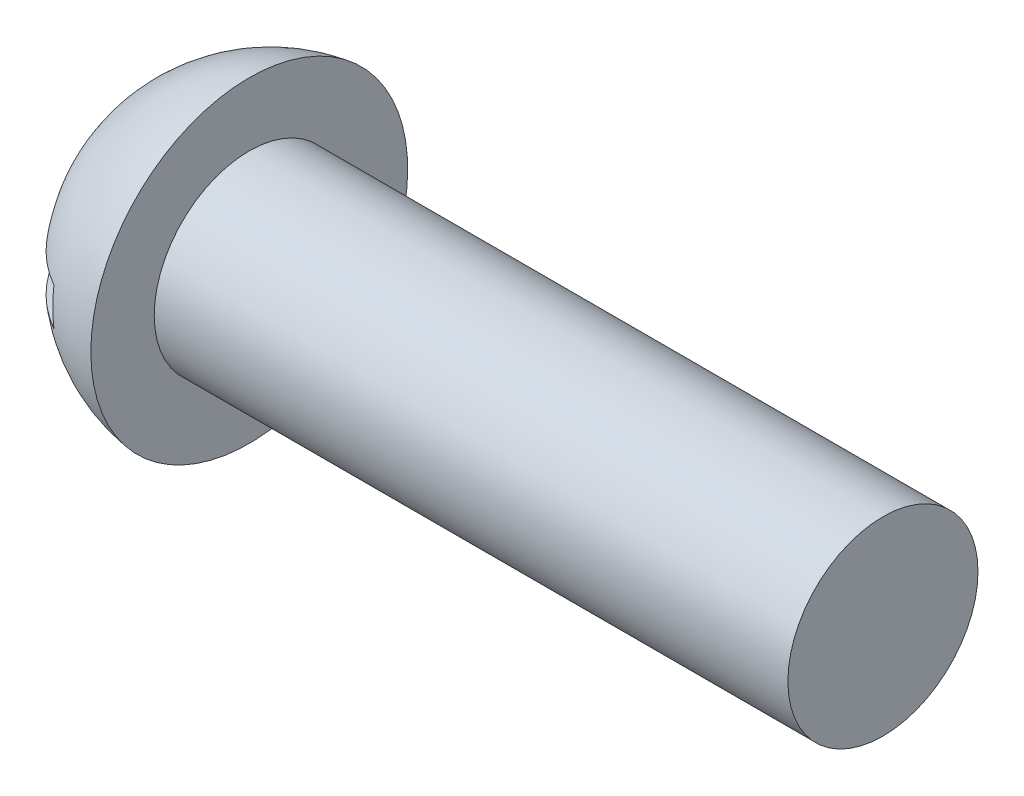
ISO-10303-21;
HEADER;
FILE_DESCRIPTION(('STEP AP214'),'2;1');
FILE_NAME('part.step','',(''),(''),'','','');
FILE_SCHEMA(('AUTOMOTIVE_DESIGN { 1 0 10303 214 1 1 1 1 }'));
ENDSEC;
DATA;
#1=APPLICATION_CONTEXT('core data for automotive mechanical design processes');
#2=APPLICATION_PROTOCOL_DEFINITION('international standard','automotive_design',2000,#1);
#3=PRODUCT_CONTEXT('',#1,'mechanical');
#4=PRODUCT('Part','Part','',(#3));
#5=PRODUCT_RELATED_PRODUCT_CATEGORY('part','',(#4));
#6=PRODUCT_DEFINITION_FORMATION('','',#4);
#7=PRODUCT_DEFINITION_CONTEXT('part definition',#1,'design');
#8=PRODUCT_DEFINITION('design','',#6,#7);
#9=PRODUCT_DEFINITION_SHAPE('','',#8);
#10=(LENGTH_UNIT() NAMED_UNIT(*) SI_UNIT(.MILLI.,.METRE.));
#11=(NAMED_UNIT(*) PLANE_ANGLE_UNIT() SI_UNIT($,.RADIAN.));
#12=(NAMED_UNIT(*) SI_UNIT($,.STERADIAN.) SOLID_ANGLE_UNIT());
#13=UNCERTAINTY_MEASURE_WITH_UNIT(LENGTH_MEASURE(1.E-05),#10,'distance_accuracy_value','');
#14=(GEOMETRIC_REPRESENTATION_CONTEXT(3) GLOBAL_UNCERTAINTY_ASSIGNED_CONTEXT((#13)) GLOBAL_UNIT_ASSIGNED_CONTEXT((#10,
#11,#12)) REPRESENTATION_CONTEXT('',''));
#15=CARTESIAN_POINT('',(0.,0.,0.));
#16=DIRECTION('',(0.,0.,1.));
#17=DIRECTION('',(1.,0.,0.));
#18=AXIS2_PLACEMENT_3D('',#15,#16,#17);
#19=CARTESIAN_POINT('',(8.128,-1.8923,-15.875));
#20=DIRECTION('',(1.,0.,0.));
#21=DIRECTION('',(0.,0.,-1.));
#22=AXIS2_PLACEMENT_3D('',#19,#20,#21);
#23=PLANE('',#22);
#24=DIRECTION('',(0.,0.,-1.));
#25=VECTOR('',#24,1.);
#26=CARTESIAN_POINT('',(8.128,0.780906045340105,-15.875));
#27=LINE('',#26,#25);
#28=CARTESIAN_POINT('',(8.128,0.780906045340053,-0.780906045340051));
#29=VERTEX_POINT('',#28);
#30=CARTESIAN_POINT('',(8.128,0.780906045340057,-2.12828967254408));
#31=VERTEX_POINT('',#30);
#32=EDGE_CURVE('E180',#29,#31,#27,.T.);
#33=ORIENTED_EDGE('',*,*,#32,.F.);
#34=DIRECTION('',(0.,-1.,0.));
#35=VECTOR('',#34,1.);
#36=CARTESIAN_POINT('',(8.128,-1.8923,-0.780906045340051));
#37=LINE('',#36,#35);
#38=CARTESIAN_POINT('',(8.128,1.8923,-0.780906045340051));
#39=VERTEX_POINT('',#38);
#40=EDGE_CURVE('E230',#39,#29,#37,.T.);
#41=ORIENTED_EDGE('',*,*,#40,.F.);
#42=DIRECTION('',(0.,0.,1.));
#43=VECTOR('',#42,1.);
#44=CARTESIAN_POINT('',(8.128,1.8923,-15.875));
#45=LINE('',#44,#43);
#46=CARTESIAN_POINT('',(8.128,1.8923,-13.8099626122346));
#47=VERTEX_POINT('',#46);
#48=EDGE_CURVE('E55',#47,#39,#45,.T.);
#49=ORIENTED_EDGE('',*,*,#48,.F.);
#50=CARTESIAN_POINT('',(8.128,0.,0.));
#51=DIRECTION('',(1.,0.,0.));
#52=DIRECTION('',(0.,0.,-1.));
#53=AXIS2_PLACEMENT_3D('',#50,#51,#52);
#54=CIRCLE('',#53,13.9390052242374);
#55=CARTESIAN_POINT('',(8.128,-1.8923,-13.8099626122346));
#56=VERTEX_POINT('',#55);
#57=EDGE_CURVE('E215',#47,#56,#54,.F.);
#58=ORIENTED_EDGE('',*,*,#57,.T.);
#59=DIRECTION('',(0.,0.,-1.));
#60=VECTOR('',#59,1.);
#61=CARTESIAN_POINT('',(8.128,-1.8923,15.875));
#62=LINE('',#61,#60);
#63=CARTESIAN_POINT('',(8.128,-1.8923,-0.780906045340051));
#64=VERTEX_POINT('',#63);
#65=EDGE_CURVE('E204',#64,#56,#62,.T.);
#66=ORIENTED_EDGE('',*,*,#65,.F.);
#67=CARTESIAN_POINT('',(8.128,-0.780906045340048,-0.780906045340051));
#68=VERTEX_POINT('',#67);
#69=EDGE_CURVE('E228',#68,#64,#37,.T.);
#70=ORIENTED_EDGE('',*,*,#69,.F.);
#71=DIRECTION('',(0.,0.,1.));
#72=VECTOR('',#71,1.);
#73=CARTESIAN_POINT('',(8.128,-0.780906045339993,-15.875));
#74=LINE('',#73,#72);
#75=CARTESIAN_POINT('',(8.128,-0.780906045340043,-2.12828967254408));
#76=VERTEX_POINT('',#75);
#77=EDGE_CURVE('E280',#76,#68,#74,.T.);
#78=ORIENTED_EDGE('',*,*,#77,.F.);
#79=DIRECTION('',(0.,1.,0.));
#80=VECTOR('',#79,1.);
#81=CARTESIAN_POINT('',(8.128,-1.89230000000006,-2.12828967254409));
#82=LINE('',#81,#80);
#83=EDGE_CURVE('E151',#76,#31,#82,.T.);
#84=ORIENTED_EDGE('',*,*,#83,.T.);
#85=EDGE_LOOP('',(#33,#41,#49,#58,#66,#70,#78,#84));
#86=FACE_BOUND('',#85,.T.);
#87=ADVANCED_FACE('F32',(#86),#23,.F.);
#88=DIRECTION('',(0.,0.,-1.));
#89=VECTOR('',#88,1.);
#90=CARTESIAN_POINT('',(8.128,0.780906045340105,-15.875));
#91=LINE('',#90,#89);
#92=CARTESIAN_POINT('',(8.128,0.780906045340043,2.12828967254408));
#93=VERTEX_POINT('',#92);
#94=CARTESIAN_POINT('',(8.128,0.780906045340048,0.780906045340048));
#95=VERTEX_POINT('',#94);
#96=EDGE_CURVE('E139',#93,#95,#91,.T.);
#97=ORIENTED_EDGE('',*,*,#96,.F.);
#98=DIRECTION('',(0.,-1.,0.));
#99=VECTOR('',#98,1.);
#100=CARTESIAN_POINT('',(8.128,-1.89230000000006,2.12828967254407));
#101=LINE('',#100,#99);
#102=CARTESIAN_POINT('',(8.128,-0.780906045340058,2.12828967254408));
#103=VERTEX_POINT('',#102);
#104=EDGE_CURVE('E150',#93,#103,#101,.T.);
#105=ORIENTED_EDGE('',*,*,#104,.T.);
#106=DIRECTION('',(0.,0.,1.));
#107=VECTOR('',#106,1.);
#108=CARTESIAN_POINT('',(8.128,-0.780906045339993,-15.875));
#109=LINE('',#108,#107);
#110=CARTESIAN_POINT('',(8.128,-0.780906045340053,0.780906045340048));
#111=VERTEX_POINT('',#110);
#112=EDGE_CURVE('E275',#111,#103,#109,.T.);
#113=ORIENTED_EDGE('',*,*,#112,.F.);
#114=DIRECTION('',(0.,1.,0.));
#115=VECTOR('',#114,1.);
#116=CARTESIAN_POINT('',(8.128,-1.8923,0.780906045340046));
#117=LINE('',#116,#115);
#118=CARTESIAN_POINT('',(8.128,-1.8923,0.780906045340046));
#119=VERTEX_POINT('',#118);
#120=EDGE_CURVE('E226',#119,#111,#117,.T.);
#121=ORIENTED_EDGE('',*,*,#120,.F.);
#122=CARTESIAN_POINT('',(8.128,-1.8923,13.8099626122346));
#123=VERTEX_POINT('',#122);
#124=EDGE_CURVE('E200',#123,#119,#62,.T.);
#125=ORIENTED_EDGE('',*,*,#124,.F.);
#126=CARTESIAN_POINT('',(8.128,1.8923,13.8099626122346));
#127=VERTEX_POINT('',#126);
#128=EDGE_CURVE('E218',#123,#127,#54,.F.);
#129=ORIENTED_EDGE('',*,*,#128,.T.);
#130=CARTESIAN_POINT('',(8.128,1.8923,0.780906045340046));
#131=VERTEX_POINT('',#130);
#132=EDGE_CURVE('E203',#131,#127,#45,.T.);
#133=ORIENTED_EDGE('',*,*,#132,.F.);
#134=EDGE_CURVE('E229',#95,#131,#117,.T.);
#135=ORIENTED_EDGE('',*,*,#134,.F.);
#136=EDGE_LOOP('',(#97,#105,#113,#121,#125,#129,#133,#135));
#137=FACE_BOUND('',#136,.T.);
#138=ADVANCED_FACE('F272',(#137),#23,.F.);
#139=CARTESIAN_POINT('',(10.9514954051796,0.,-0.597770008354219));
#140=DIRECTION('',(-0.0647254535664844,0.,0.997903109355118));
#141=DIRECTION('',(0.997903109355118,0.,0.0647254535664844));
#142=AXIS2_PLACEMENT_3D('',#139,#140,#141);
#143=PLANE('',#142);
#144=ORIENTED_EDGE('',*,*,#40,.T.);
#145=DIRECTION('',(0.995819354482396,-0.0645902981811632,0.064590298181163));
#146=VECTOR('',#145,1.);
#147=CARTESIAN_POINT('',(10.9899441329414,0.59527616769965,-0.595276167699648));
#148=LINE('',#147,#146);
#149=CARTESIAN_POINT('',(10.0838,0.654050000000002,-0.654049999999997));
#150=VERTEX_POINT('',#149);
#151=EDGE_CURVE('E238',#29,#150,#148,.T.);
#152=ORIENTED_EDGE('',*,*,#151,.T.);
#153=DIRECTION('',(0.797480422628462,-0.601123467182789,0.0517257452964305));
#154=VECTOR('',#153,1.);
#155=CARTESIAN_POINT('',(0.,8.255,-1.3081));
#156=LINE('',#155,#154);
#157=CARTESIAN_POINT('',(1.6618990815732,7.00229647314665,-1.20030679760577));
#158=VERTEX_POINT('',#157);
#159=EDGE_CURVE('E162',#158,#150,#156,.T.);
#160=ORIENTED_EDGE('',*,*,#159,.F.);
#161=CARTESIAN_POINT('',(16.0336471531862,0.,-0.268134221172429));
#162=DIRECTION('',(-0.0647254535664844,0.,0.997903109355118));
#163=DIRECTION('',(0.997903109355118,0.,0.0647254535664844));
#164=AXIS2_PLACEMENT_3D('',#161,#162,#163);
#165=CIRCLE('',#164,16.0140015063072);
#166=CARTESIAN_POINT('',(0.165185159653955,1.8923,-1.2973858492164));
#167=VERTEX_POINT('',#166);
#168=EDGE_CURVE('E196',#167,#158,#165,.F.);
#169=ORIENTED_EDGE('',*,*,#168,.F.);
#170=DIRECTION('',(-0.997903109355118,0.,-0.0647254535664844));
#171=VECTOR('',#170,1.);
#172=CARTESIAN_POINT('',(7.1530765262189,1.8923,-0.84414100617094));
#173=LINE('',#172,#171);
#174=EDGE_CURVE('E193',#39,#167,#173,.T.);
#175=ORIENTED_EDGE('',*,*,#174,.F.);
#176=EDGE_LOOP('',(#144,#152,#160,#169,#175));
#177=FACE_BOUND('',#176,.T.);
#178=ADVANCED_FACE('F237',(#177),#143,.T.);
#179=DIRECTION('',(0.797480422628462,0.601123467182789,0.0517257452964305));
#180=VECTOR('',#179,1.);
#181=CARTESIAN_POINT('',(0.,-8.255,-1.3081));
#182=LINE('',#181,#180);
#183=CARTESIAN_POINT('',(1.66189908157319,-7.00229647314666,-1.20030679760577));
#184=VERTEX_POINT('',#183);
#185=CARTESIAN_POINT('',(10.0838,-0.65405,-0.65405));
#186=VERTEX_POINT('',#185);
#187=EDGE_CURVE('E163',#184,#186,#182,.T.);
#188=ORIENTED_EDGE('',*,*,#187,.T.);
#189=DIRECTION('',(-0.995819354482397,-0.0645902981811627,-0.064590298181163));
#190=VECTOR('',#189,1.);
#191=CARTESIAN_POINT('',(10.9899441329414,-0.595276167699646,-0.595276167699648));
#192=LINE('',#191,#190);
#193=EDGE_CURVE('E277',#186,#68,#192,.T.);
#194=ORIENTED_EDGE('',*,*,#193,.T.);
#195=ORIENTED_EDGE('',*,*,#69,.T.);
#196=DIRECTION('',(0.997903109355118,0.,0.0647254535664844));
#197=VECTOR('',#196,1.);
#198=CARTESIAN_POINT('',(9.20380049716607,-1.8923,-0.711128053395398));
#199=LINE('',#198,#197);
#200=CARTESIAN_POINT('',(0.165185159653955,-1.8923,-1.2973858492164));
#201=VERTEX_POINT('',#200);
#202=EDGE_CURVE('E190',#201,#64,#199,.T.);
#203=ORIENTED_EDGE('',*,*,#202,.F.);
#204=EDGE_CURVE('E199',#184,#201,#165,.F.);
#205=ORIENTED_EDGE('',*,*,#204,.F.);
#206=EDGE_LOOP('',(#188,#194,#195,#203,#205));
#207=FACE_BOUND('',#206,.T.);
#208=ADVANCED_FACE('F293',(#207),#143,.T.);
#209=CARTESIAN_POINT('',(10.9514954051796,0.,0.597770008354219));
#210=DIRECTION('',(-0.0647254535664843,0.,-0.997903109355118));
#211=DIRECTION('',(-0.997903109355118,0.,0.0647254535664843));
#212=AXIS2_PLACEMENT_3D('',#209,#210,#211);
#213=PLANE('',#212);
#214=DIRECTION('',(0.797480422628462,-0.601123467182789,-0.0517257452964305));
#215=VECTOR('',#214,1.);
#216=CARTESIAN_POINT('',(0.,8.255,1.3081));
#217=LINE('',#216,#215);
#218=CARTESIAN_POINT('',(1.6618990815732,7.00229647314665,1.20030679760577));
#219=VERTEX_POINT('',#218);
#220=CARTESIAN_POINT('',(10.0838,0.654049999999998,0.654050000000002));
#221=VERTEX_POINT('',#220);
#222=EDGE_CURVE('E155',#219,#221,#217,.T.);
#223=ORIENTED_EDGE('',*,*,#222,.T.);
#224=DIRECTION('',(-0.995819354482397,0.0645902981811628,0.0645902981811629));
#225=VECTOR('',#224,1.);
#226=CARTESIAN_POINT('',(10.9899441329414,0.595276167699645,0.595276167699648));
#227=LINE('',#226,#225);
#228=EDGE_CURVE('E11',#221,#95,#227,.T.);
#229=ORIENTED_EDGE('',*,*,#228,.T.);
#230=ORIENTED_EDGE('',*,*,#134,.T.);
#231=DIRECTION('',(0.997903109355118,0.,-0.0647254535664843));
#232=VECTOR('',#231,1.);
#233=CARTESIAN_POINT('',(9.20380049716607,1.8923,0.711128053395398));
#234=LINE('',#233,#232);
#235=CARTESIAN_POINT('',(0.165185159653958,1.8923,1.2973858492164));
#236=VERTEX_POINT('',#235);
#237=EDGE_CURVE('E185',#236,#131,#234,.T.);
#238=ORIENTED_EDGE('',*,*,#237,.F.);
#239=CARTESIAN_POINT('',(16.0336471531862,0.,0.26813422117243));
#240=DIRECTION('',(-0.0647254535664843,0.,-0.997903109355118));
#241=DIRECTION('',(-0.997903109355118,0.,0.0647254535664843));
#242=AXIS2_PLACEMENT_3D('',#239,#240,#241);
#243=CIRCLE('',#242,16.0140015063072);
#244=EDGE_CURVE('E158',#219,#236,#243,.F.);
#245=ORIENTED_EDGE('',*,*,#244,.F.);
#246=EDGE_LOOP('',(#223,#229,#230,#238,#245));
#247=FACE_BOUND('',#246,.T.);
#248=ADVANCED_FACE('F156',(#247),#213,.T.);
#249=ORIENTED_EDGE('',*,*,#120,.T.);
#250=DIRECTION('',(0.995819354482396,0.0645902981811631,-0.0645902981811629));
#251=VECTOR('',#250,1.);
#252=CARTESIAN_POINT('',(10.9899441329414,-0.59527616769965,0.595276167699648));
#253=LINE('',#252,#251);
#254=CARTESIAN_POINT('',(10.0838,-0.65405,0.65405));
#255=VERTEX_POINT('',#254);
#256=EDGE_CURVE('E264',#111,#255,#253,.T.);
#257=ORIENTED_EDGE('',*,*,#256,.T.);
#258=DIRECTION('',(0.797480422628462,0.601123467182789,-0.0517257452964303));
#259=VECTOR('',#258,1.);
#260=CARTESIAN_POINT('',(0.,-8.255,1.3081));
#261=LINE('',#260,#259);
#262=CARTESIAN_POINT('',(1.6618990815732,-7.00229647314666,1.20030679760577));
#263=VERTEX_POINT('',#262);
#264=EDGE_CURVE('E254',#263,#255,#261,.T.);
#265=ORIENTED_EDGE('',*,*,#264,.F.);
#266=CARTESIAN_POINT('',(0.165185159653958,-1.8923,1.2973858492164));
#267=VERTEX_POINT('',#266);
#268=EDGE_CURVE('E189',#267,#263,#243,.F.);
#269=ORIENTED_EDGE('',*,*,#268,.F.);
#270=DIRECTION('',(-0.997903109355118,0.,0.0647254535664843));
#271=VECTOR('',#270,1.);
#272=CARTESIAN_POINT('',(7.1530765262189,-1.8923,0.844141006170938));
#273=LINE('',#272,#271);
#274=EDGE_CURVE('E47',#119,#267,#273,.T.);
#275=ORIENTED_EDGE('',*,*,#274,.F.);
#276=EDGE_LOOP('',(#249,#257,#265,#269,#275));
#277=FACE_BOUND('',#276,.T.);
#278=ADVANCED_FACE('F263',(#277),#213,.T.);
#279=CARTESIAN_POINT('',(16.0162555758684,0.,0.));
#280=DIRECTION('',(-1.,0.,0.));
#281=DIRECTION('',(0.,1.,0.));
#282=AXIS2_PLACEMENT_3D('',#279,#280,#281);
#283=SPHERICAL_SURFACE('',#282,16.0162555758684);
#284=CARTESIAN_POINT('',(13.8938,0.,0.));
#285=DIRECTION('',(-1.,0.,0.));
#286=DIRECTION('',(0.,0.,1.));
#287=AXIS2_PLACEMENT_3D('',#284,#285,#286);
#288=CIRCLE('',#287,15.875);
#289=CARTESIAN_POINT('',(13.8938,0.,15.875));
#290=VERTEX_POINT('',#289);
#291=EDGE_CURVE('E212',#290,#290,#288,.T.);
#292=ORIENTED_EDGE('',*,*,#291,.T.);
#293=EDGE_LOOP('',(#292));
#294=FACE_BOUND('',#293,.T.);
#295=CARTESIAN_POINT('',(16.0162555758684,1.8923,0.));
#296=DIRECTION('',(0.,-1.,0.));
#297=DIRECTION('',(0.,0.,-1.));
#298=AXIS2_PLACEMENT_3D('',#295,#296,#297);
#299=CIRCLE('',#298,15.9040763133712);
#300=EDGE_CURVE('E223',#47,#167,#299,.F.);
#301=ORIENTED_EDGE('',*,*,#300,.T.);
#302=ORIENTED_EDGE('',*,*,#168,.T.);
#303=CARTESIAN_POINT('',(14.181197617256,-2.43447956414071,0.));
#304=DIRECTION('',(0.601929253251909,0.798549418683402,0.));
#305=DIRECTION('',(-0.798549418683402,0.601929253251909,0.));
#306=AXIS2_PLACEMENT_3D('',#303,#304,#305);
#307=CIRCLE('',#306,15.7234320112325);
#308=EDGE_CURVE('E40',#219,#158,#307,.F.);
#309=ORIENTED_EDGE('',*,*,#308,.F.);
#310=ORIENTED_EDGE('',*,*,#244,.T.);
#311=EDGE_CURVE('E222',#236,#127,#299,.F.);
#312=ORIENTED_EDGE('',*,*,#311,.T.);
#313=ORIENTED_EDGE('',*,*,#128,.F.);
#314=CARTESIAN_POINT('',(16.0162555758684,-1.8923,0.));
#315=DIRECTION('',(0.,1.,0.));
#316=DIRECTION('',(0.,0.,1.));
#317=AXIS2_PLACEMENT_3D('',#314,#315,#316);
#318=CIRCLE('',#317,15.9040763133712);
#319=EDGE_CURVE('E219',#123,#267,#318,.F.);
#320=ORIENTED_EDGE('',*,*,#319,.T.);
#321=ORIENTED_EDGE('',*,*,#268,.T.);
#322=CARTESIAN_POINT('',(14.181197617256,2.43447956414071,0.));
#323=DIRECTION('',(0.601929253251909,-0.798549418683402,0.));
#324=DIRECTION('',(0.798549418683402,0.601929253251909,0.));
#325=AXIS2_PLACEMENT_3D('',#322,#323,#324);
#326=CIRCLE('',#325,15.7234320112325);
#327=EDGE_CURVE('E233',#184,#263,#326,.F.);
#328=ORIENTED_EDGE('',*,*,#327,.F.);
#329=ORIENTED_EDGE('',*,*,#204,.T.);
#330=EDGE_CURVE('E217',#201,#56,#318,.F.);
#331=ORIENTED_EDGE('',*,*,#330,.T.);
#332=ORIENTED_EDGE('',*,*,#57,.F.);
#333=EDGE_LOOP('',(#301,#302,#309,#310,#312,#313,#320,#321,#328,#329,#331,#332));
#334=FACE_BOUND('',#333,.T.);
#335=ADVANCED_FACE('F34',(#294,#334),#283,.T.);
#336=CARTESIAN_POINT('',(8.128,1.8923,-15.875));
#337=DIRECTION('',(0.,-1.,0.));
#338=DIRECTION('',(0.,0.,-1.));
#339=AXIS2_PLACEMENT_3D('',#336,#337,#338);
#340=PLANE('',#339);
#341=ORIENTED_EDGE('',*,*,#48,.T.);
#342=ORIENTED_EDGE('',*,*,#174,.T.);
#343=ORIENTED_EDGE('',*,*,#300,.F.);
#344=EDGE_LOOP('',(#341,#342,#343));
#345=FACE_BOUND('',#344,.T.);
#346=ADVANCED_FACE('F242',(#345),#340,.T.);
#347=ORIENTED_EDGE('',*,*,#311,.F.);
#348=ORIENTED_EDGE('',*,*,#237,.T.);
#349=ORIENTED_EDGE('',*,*,#132,.T.);
#350=EDGE_LOOP('',(#347,#348,#349));
#351=FACE_BOUND('',#350,.T.);
#352=ADVANCED_FACE('F300',(#351),#340,.T.);
#353=CARTESIAN_POINT('',(8.128,-1.8923,15.875));
#354=DIRECTION('',(0.,1.,0.));
#355=DIRECTION('',(0.,0.,1.));
#356=AXIS2_PLACEMENT_3D('',#353,#354,#355);
#357=PLANE('',#356);
#358=ORIENTED_EDGE('',*,*,#330,.F.);
#359=ORIENTED_EDGE('',*,*,#202,.T.);
#360=ORIENTED_EDGE('',*,*,#65,.T.);
#361=EDGE_LOOP('',(#358,#359,#360));
#362=FACE_BOUND('',#361,.T.);
#363=ADVANCED_FACE('F298',(#362),#357,.T.);
#364=ORIENTED_EDGE('',*,*,#124,.T.);
#365=ORIENTED_EDGE('',*,*,#274,.T.);
#366=ORIENTED_EDGE('',*,*,#319,.F.);
#367=EDGE_LOOP('',(#364,#365,#366));
#368=FACE_BOUND('',#367,.T.);
#369=ADVANCED_FACE('F270',(#368),#357,.T.);
#370=CARTESIAN_POINT('',(13.8938,9.52499999999998,0.));
#371=DIRECTION('',(-1.,0.,0.));
#372=DIRECTION('',(0.,0.,1.));
#373=AXIS2_PLACEMENT_3D('',#370,#371,#372);
#374=PLANE('',#373);
#375=ORIENTED_EDGE('',*,*,#291,.F.);
#376=EDGE_LOOP('',(#375));
#377=FACE_BOUND('',#376,.T.);
#378=CARTESIAN_POINT('',(13.8938,0.,0.));
#379=DIRECTION('',(-1.,0.,0.));
#380=DIRECTION('',(0.,0.,1.));
#381=AXIS2_PLACEMENT_3D('',#378,#379,#380);
#382=CIRCLE('',#381,9.52499999999998);
#383=CARTESIAN_POINT('',(13.8938,0.,9.52499999999998));
#384=VERTEX_POINT('',#383);
#385=EDGE_CURVE('E209',#384,#384,#382,.T.);
#386=ORIENTED_EDGE('',*,*,#385,.T.);
#387=EDGE_LOOP('',(#386));
#388=FACE_BOUND('',#387,.T.);
#389=ADVANCED_FACE('F306',(#377,#388),#374,.F.);
#390=CARTESIAN_POINT('',(0.,0.,0.));
#391=DIRECTION('',(-1.,0.,0.));
#392=DIRECTION('',(0.,0.,1.));
#393=AXIS2_PLACEMENT_3D('',#390,#391,#392);
#394=CYLINDRICAL_SURFACE('',#393,9.52499999999999);
#395=ORIENTED_EDGE('',*,*,#385,.F.);
#396=EDGE_LOOP('',(#395));
#397=FACE_BOUND('',#396,.T.);
#398=CARTESIAN_POINT('',(77.3938,0.,0.));
#399=DIRECTION('',(-1.,0.,0.));
#400=DIRECTION('',(0.,0.,1.));
#401=AXIS2_PLACEMENT_3D('',#398,#399,#400);
#402=CIRCLE('',#401,9.525);
#403=CARTESIAN_POINT('',(77.3938,0.,9.525));
#404=VERTEX_POINT('',#403);
#405=EDGE_CURVE('E206',#404,#404,#402,.T.);
#406=ORIENTED_EDGE('',*,*,#405,.T.);
#407=EDGE_LOOP('',(#406));
#408=FACE_BOUND('',#407,.T.);
#409=ADVANCED_FACE('F330',(#397,#408),#394,.T.);
#410=CARTESIAN_POINT('',(77.3938,0.,0.));
#411=DIRECTION('',(-1.,0.,0.));
#412=DIRECTION('',(0.,0.,1.));
#413=AXIS2_PLACEMENT_3D('',#410,#411,#412);
#414=PLANE('',#413);
#415=ORIENTED_EDGE('',*,*,#405,.F.);
#416=EDGE_LOOP('',(#415));
#417=FACE_BOUND('',#416,.T.);
#418=ADVANCED_FACE('F335',(#417),#414,.F.);
#419=CARTESIAN_POINT('',(10.0838,0.65405,-0.65405));
#420=DIRECTION('',(-1.,0.,0.));
#421=DIRECTION('',(0.,0.,1.));
#422=AXIS2_PLACEMENT_3D('',#419,#420,#421);
#423=PLANE('',#422);
#424=DIRECTION('',(0.,1.,0.));
#425=VECTOR('',#424,1.);
#426=CARTESIAN_POINT('',(10.0838,-0.65405,-0.65405));
#427=LINE('',#426,#425);
#428=EDGE_CURVE('E177',#186,#150,#427,.T.);
#429=ORIENTED_EDGE('',*,*,#428,.F.);
#430=DIRECTION('',(0.,0.,1.));
#431=VECTOR('',#430,1.);
#432=CARTESIAN_POINT('',(10.0838,-0.65405,-0.65405));
#433=LINE('',#432,#431);
#434=EDGE_CURVE('E172',#186,#255,#433,.T.);
#435=ORIENTED_EDGE('',*,*,#434,.T.);
#436=DIRECTION('',(0.,-1.,0.));
#437=VECTOR('',#436,1.);
#438=CARTESIAN_POINT('',(10.0838,0.65405,0.65405));
#439=LINE('',#438,#437);
#440=EDGE_CURVE('E147',#221,#255,#439,.T.);
#441=ORIENTED_EDGE('',*,*,#440,.F.);
#442=DIRECTION('',(0.,0.,-1.));
#443=VECTOR('',#442,1.);
#444=CARTESIAN_POINT('',(10.0838,0.65405,0.65405));
#445=LINE('',#444,#443);
#446=EDGE_CURVE('E170',#221,#150,#445,.T.);
#447=ORIENTED_EDGE('',*,*,#446,.T.);
#448=EDGE_LOOP('',(#429,#435,#441,#447));
#449=FACE_BOUND('',#448,.T.);
#450=ADVANCED_FACE('F169',(#449),#423,.T.);
#451=CARTESIAN_POINT('',(10.0838,0.65405,0.65405));
#452=DIRECTION('',(0.601929253251909,0.798549418683402,0.));
#453=DIRECTION('',(-0.798549418683402,0.601929253251909,0.));
#454=AXIS2_PLACEMENT_3D('',#451,#452,#453);
#455=PLANE('',#454);
#456=ORIENTED_EDGE('',*,*,#308,.T.);
#457=ORIENTED_EDGE('',*,*,#159,.T.);
#458=ORIENTED_EDGE('',*,*,#446,.F.);
#459=ORIENTED_EDGE('',*,*,#222,.F.);
#460=EDGE_LOOP('',(#456,#457,#458,#459));
#461=FACE_BOUND('',#460,.T.);
#462=ADVANCED_FACE('F175',(#461),#455,.F.);
#463=CARTESIAN_POINT('',(0.,-8.255,-1.3081));
#464=DIRECTION('',(0.601929253251909,-0.798549418683402,0.));
#465=DIRECTION('',(0.798549418683402,0.601929253251909,0.));
#466=AXIS2_PLACEMENT_3D('',#463,#464,#465);
#467=PLANE('',#466);
#468=ORIENTED_EDGE('',*,*,#327,.T.);
#469=ORIENTED_EDGE('',*,*,#264,.T.);
#470=ORIENTED_EDGE('',*,*,#434,.F.);
#471=ORIENTED_EDGE('',*,*,#187,.F.);
#472=EDGE_LOOP('',(#468,#469,#470,#471));
#473=FACE_BOUND('',#472,.T.);
#474=ADVANCED_FACE('F258',(#473),#467,.F.);
#475=CARTESIAN_POINT('',(10.9514954051796,-0.597770008354219,0.));
#476=DIRECTION('',(-0.0647254535664843,0.997903109355118,0.));
#477=DIRECTION('',(-0.997903109355118,-0.0647254535664843,0.));
#478=AXIS2_PLACEMENT_3D('',#475,#476,#477);
#479=PLANE('',#478);
#480=ORIENTED_EDGE('',*,*,#112,.T.);
#481=DIRECTION('',(0.797480422628462,0.0517257452964326,-0.601123467182789));
#482=VECTOR('',#481,1.);
#483=CARTESIAN_POINT('',(0.,-1.30810000000003,8.255));
#484=LINE('',#483,#482);
#485=EDGE_CURVE('E152',#103,#255,#484,.T.);
#486=ORIENTED_EDGE('',*,*,#485,.T.);
#487=ORIENTED_EDGE('',*,*,#256,.F.);
#488=EDGE_LOOP('',(#480,#486,#487));
#489=FACE_BOUND('',#488,.T.);
#490=ADVANCED_FACE('F350',(#489),#479,.T.);
#491=CARTESIAN_POINT('',(10.9514954051796,0.597770008354219,0.));
#492=DIRECTION('',(-0.0647254535664844,-0.997903109355118,0.));
#493=DIRECTION('',(0.997903109355118,-0.0647254535664844,0.));
#494=AXIS2_PLACEMENT_3D('',#491,#492,#493);
#495=PLANE('',#494);
#496=ORIENTED_EDGE('',*,*,#96,.T.);
#497=ORIENTED_EDGE('',*,*,#228,.F.);
#498=DIRECTION('',(0.797480422628462,-0.0517257452964284,-0.60112346718279));
#499=VECTOR('',#498,1.);
#500=CARTESIAN_POINT('',(0.,1.30809999999997,8.25500000000001));
#501=LINE('',#500,#499);
#502=EDGE_CURVE('E137',#93,#221,#501,.T.);
#503=ORIENTED_EDGE('',*,*,#502,.F.);
#504=EDGE_LOOP('',(#496,#497,#503));
#505=FACE_BOUND('',#504,.T.);
#506=ADVANCED_FACE('F136',(#505),#495,.T.);
#507=CARTESIAN_POINT('',(10.0838,-0.654050000000003,0.654049999999998));
#508=DIRECTION('',(0.601929253251909,0.,0.798549418683402));
#509=DIRECTION('',(-0.798549418683402,0.,0.601929253251909));
#510=AXIS2_PLACEMENT_3D('',#507,#508,#509);
#511=PLANE('',#510);
#512=ORIENTED_EDGE('',*,*,#502,.T.);
#513=ORIENTED_EDGE('',*,*,#440,.T.);
#514=ORIENTED_EDGE('',*,*,#485,.F.);
#515=ORIENTED_EDGE('',*,*,#104,.F.);
#516=EDGE_LOOP('',(#512,#513,#514,#515));
#517=FACE_BOUND('',#516,.T.);
#518=ADVANCED_FACE('F144',(#517),#511,.F.);
#519=ORIENTED_EDGE('',*,*,#32,.T.);
#520=DIRECTION('',(0.797480422628462,-0.0517257452964326,0.601123467182789));
#521=VECTOR('',#520,1.);
#522=CARTESIAN_POINT('',(0.,1.30810000000003,-8.255));
#523=LINE('',#522,#521);
#524=EDGE_CURVE('E492',#31,#150,#523,.T.);
#525=ORIENTED_EDGE('',*,*,#524,.T.);
#526=ORIENTED_EDGE('',*,*,#151,.F.);
#527=EDGE_LOOP('',(#519,#525,#526));
#528=FACE_BOUND('',#527,.T.);
#529=ADVANCED_FACE('F459',(#528),#495,.T.);
#530=ORIENTED_EDGE('',*,*,#77,.T.);
#531=ORIENTED_EDGE('',*,*,#193,.F.);
#532=DIRECTION('',(0.797480422628462,0.0517257452964282,0.60112346718279));
#533=VECTOR('',#532,1.);
#534=CARTESIAN_POINT('',(0.,-1.30809999999997,-8.25500000000001));
#535=LINE('',#534,#533);
#536=EDGE_CURVE('E290',#76,#186,#535,.T.);
#537=ORIENTED_EDGE('',*,*,#536,.F.);
#538=EDGE_LOOP('',(#530,#531,#537));
#539=FACE_BOUND('',#538,.T.);
#540=ADVANCED_FACE('F289',(#539),#479,.T.);
#541=CARTESIAN_POINT('',(0.,1.30810000000003,-8.255));
#542=DIRECTION('',(0.601929253251909,0.,-0.798549418683402));
#543=DIRECTION('',(0.798549418683402,0.,0.601929253251909));
#544=AXIS2_PLACEMENT_3D('',#541,#542,#543);
#545=PLANE('',#544);
#546=ORIENTED_EDGE('',*,*,#536,.T.);
#547=ORIENTED_EDGE('',*,*,#428,.T.);
#548=ORIENTED_EDGE('',*,*,#524,.F.);
#549=ORIENTED_EDGE('',*,*,#83,.F.);
#550=EDGE_LOOP('',(#546,#547,#548,#549));
#551=FACE_BOUND('',#550,.T.);
#552=ADVANCED_FACE('F353',(#551),#545,.F.);
#553=CLOSED_SHELL('',(#87,#138,#178,#208,#248,#278,#335,#346,#352,#363,#369,#389,#409,#418,#450,
#462,#474,#490,#506,#518,#529,#540,#552));
#554=MANIFOLD_SOLID_BREP('B2',#553);
#555=ADVANCED_BREP_SHAPE_REPRESENTATION('',(#18,#554),#14);
#556=SHAPE_DEFINITION_REPRESENTATION(#9,#555);
ENDSEC;
END-ISO-10303-21;
